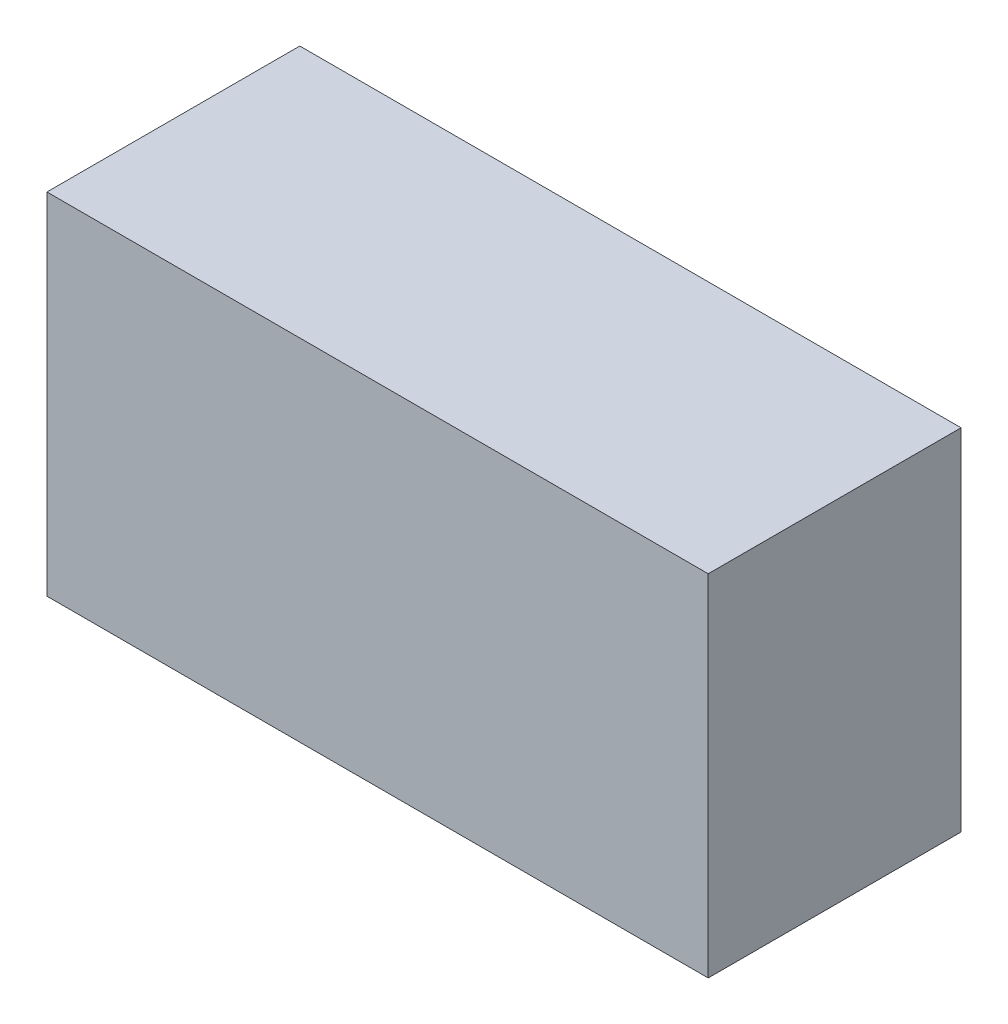
ISO-10303-21;
HEADER;
FILE_DESCRIPTION(('STEP AP214'),'2;1');
FILE_NAME('part.step','',(''),(''),'','','');
FILE_SCHEMA(('AUTOMOTIVE_DESIGN { 1 0 10303 214 1 1 1 1 }'));
ENDSEC;
DATA;
#1=APPLICATION_CONTEXT('core data for automotive mechanical design processes');
#2=APPLICATION_PROTOCOL_DEFINITION('international standard','automotive_design',2000,#1);
#3=PRODUCT_CONTEXT('',#1,'mechanical');
#4=PRODUCT('Part','Part','',(#3));
#5=PRODUCT_RELATED_PRODUCT_CATEGORY('part','',(#4));
#6=PRODUCT_DEFINITION_FORMATION('','',#4);
#7=PRODUCT_DEFINITION_CONTEXT('part definition',#1,'design');
#8=PRODUCT_DEFINITION('design','',#6,#7);
#9=PRODUCT_DEFINITION_SHAPE('','',#8);
#10=(LENGTH_UNIT() NAMED_UNIT(*) SI_UNIT(.MILLI.,.METRE.));
#11=(NAMED_UNIT(*) PLANE_ANGLE_UNIT() SI_UNIT($,.RADIAN.));
#12=(NAMED_UNIT(*) SI_UNIT($,.STERADIAN.) SOLID_ANGLE_UNIT());
#13=UNCERTAINTY_MEASURE_WITH_UNIT(LENGTH_MEASURE(1.E-05),#10,'distance_accuracy_value','');
#14=(GEOMETRIC_REPRESENTATION_CONTEXT(3) GLOBAL_UNCERTAINTY_ASSIGNED_CONTEXT((#13)) GLOBAL_UNIT_ASSIGNED_CONTEXT((#10,
#11,#12)) REPRESENTATION_CONTEXT('',''));
#15=CARTESIAN_POINT('',(0.,0.,0.));
#16=DIRECTION('',(0.,0.,1.));
#17=DIRECTION('',(1.,0.,0.));
#18=AXIS2_PLACEMENT_3D('',#15,#16,#17);
#19=CARTESIAN_POINT('',(-1.69999914,-0.90000074,1.29999994));
#20=DIRECTION('',(0.,0.,-1.));
#21=DIRECTION('',(-1.,0.,0.));
#22=AXIS2_PLACEMENT_3D('',#19,#20,#21);
#23=PLANE('',#22);
#24=DIRECTION('',(0.,1.,0.));
#25=VECTOR('',#24,1.);
#26=CARTESIAN_POINT('',(1.69999914,-0.90000074,1.29999994));
#27=LINE('',#26,#25);
#28=CARTESIAN_POINT('',(1.69999914,-0.90000074,1.29999994));
#29=VERTEX_POINT('',#28);
#30=CARTESIAN_POINT('',(1.69999914,0.90000074,1.29999994));
#31=VERTEX_POINT('',#30);
#32=EDGE_CURVE('E55',#29,#31,#27,.T.);
#33=ORIENTED_EDGE('',*,*,#32,.T.);
#34=DIRECTION('',(1.,0.,0.));
#35=VECTOR('',#34,1.);
#36=CARTESIAN_POINT('',(1.69999914,0.90000074,1.29999994));
#37=LINE('',#36,#35);
#38=CARTESIAN_POINT('',(-1.69999914,0.90000074,1.29999994));
#39=VERTEX_POINT('',#38);
#40=EDGE_CURVE('E57',#31,#39,#37,.F.);
#41=ORIENTED_EDGE('',*,*,#40,.T.);
#42=DIRECTION('',(0.,1.,0.));
#43=VECTOR('',#42,1.);
#44=CARTESIAN_POINT('',(-1.69999914,0.90000074,1.29999994));
#45=LINE('',#44,#43);
#46=CARTESIAN_POINT('',(-1.69999914,-0.90000074,1.29999994));
#47=VERTEX_POINT('',#46);
#48=EDGE_CURVE('E20',#39,#47,#45,.F.);
#49=ORIENTED_EDGE('',*,*,#48,.T.);
#50=DIRECTION('',(1.,0.,0.));
#51=VECTOR('',#50,1.);
#52=CARTESIAN_POINT('',(-1.69999914,-0.90000074,1.29999994));
#53=LINE('',#52,#51);
#54=EDGE_CURVE('E80',#47,#29,#53,.T.);
#55=ORIENTED_EDGE('',*,*,#54,.T.);
#56=EDGE_LOOP('',(#33,#41,#49,#55));
#57=FACE_BOUND('',#56,.T.);
#58=ADVANCED_FACE('F17',(#57),#23,.F.);
#59=CARTESIAN_POINT('',(-1.69999914,0.90000074,0.));
#60=DIRECTION('',(1.,0.,0.));
#61=DIRECTION('',(0.,0.,-1.));
#62=AXIS2_PLACEMENT_3D('',#59,#60,#61);
#63=PLANE('',#62);
#64=DIRECTION('',(0.,0.,1.));
#65=VECTOR('',#64,1.);
#66=CARTESIAN_POINT('',(-1.69999914,-0.90000074,0.));
#67=LINE('',#66,#65);
#68=CARTESIAN_POINT('',(-1.69999914,-0.90000074,0.));
#69=VERTEX_POINT('',#68);
#70=EDGE_CURVE('E68',#69,#47,#67,.T.);
#71=ORIENTED_EDGE('',*,*,#70,.T.);
#72=ORIENTED_EDGE('',*,*,#48,.F.);
#73=DIRECTION('',(0.,0.,-1.));
#74=VECTOR('',#73,1.);
#75=CARTESIAN_POINT('',(-1.69999914,0.90000074,0.));
#76=LINE('',#75,#74);
#77=CARTESIAN_POINT('',(-1.69999914,0.90000074,0.));
#78=VERTEX_POINT('',#77);
#79=EDGE_CURVE('E63',#39,#78,#76,.T.);
#80=ORIENTED_EDGE('',*,*,#79,.T.);
#81=DIRECTION('',(0.,1.,0.));
#82=VECTOR('',#81,1.);
#83=CARTESIAN_POINT('',(-1.69999914,-0.90000074,0.));
#84=LINE('',#83,#82);
#85=EDGE_CURVE('E83',#69,#78,#84,.T.);
#86=ORIENTED_EDGE('',*,*,#85,.F.);
#87=EDGE_LOOP('',(#71,#72,#80,#86));
#88=FACE_BOUND('',#87,.T.);
#89=ADVANCED_FACE('F65',(#88),#63,.F.);
#90=CARTESIAN_POINT('',(1.69999914,0.90000074,0.));
#91=DIRECTION('',(0.,-1.,0.));
#92=DIRECTION('',(0.,0.,-1.));
#93=AXIS2_PLACEMENT_3D('',#90,#91,#92);
#94=PLANE('',#93);
#95=ORIENTED_EDGE('',*,*,#79,.F.);
#96=ORIENTED_EDGE('',*,*,#40,.F.);
#97=DIRECTION('',(0.,0.,1.));
#98=VECTOR('',#97,1.);
#99=CARTESIAN_POINT('',(1.69999914,0.90000074,0.));
#100=LINE('',#99,#98);
#101=CARTESIAN_POINT('',(1.69999914,0.90000074,0.));
#102=VERTEX_POINT('',#101);
#103=EDGE_CURVE('E75',#31,#102,#100,.F.);
#104=ORIENTED_EDGE('',*,*,#103,.T.);
#105=DIRECTION('',(-1.,0.,0.));
#106=VECTOR('',#105,1.);
#107=CARTESIAN_POINT('',(-1.69999914,0.90000074,0.));
#108=LINE('',#107,#106);
#109=EDGE_CURVE('E72',#78,#102,#108,.F.);
#110=ORIENTED_EDGE('',*,*,#109,.F.);
#111=EDGE_LOOP('',(#95,#96,#104,#110));
#112=FACE_BOUND('',#111,.T.);
#113=ADVANCED_FACE('F70',(#112),#94,.F.);
#114=CARTESIAN_POINT('',(1.69999914,-0.90000074,0.));
#115=DIRECTION('',(-1.,0.,0.));
#116=DIRECTION('',(0.,0.,1.));
#117=AXIS2_PLACEMENT_3D('',#114,#115,#116);
#118=PLANE('',#117);
#119=ORIENTED_EDGE('',*,*,#103,.F.);
#120=ORIENTED_EDGE('',*,*,#32,.F.);
#121=DIRECTION('',(0.,0.,1.));
#122=VECTOR('',#121,1.);
#123=CARTESIAN_POINT('',(1.69999914,-0.90000074,0.));
#124=LINE('',#123,#122);
#125=CARTESIAN_POINT('',(1.69999914,-0.90000074,0.));
#126=VERTEX_POINT('',#125);
#127=EDGE_CURVE('E35',#29,#126,#124,.F.);
#128=ORIENTED_EDGE('',*,*,#127,.T.);
#129=DIRECTION('',(0.,1.,0.));
#130=VECTOR('',#129,1.);
#131=CARTESIAN_POINT('',(1.69999914,-0.90000074,0.));
#132=LINE('',#131,#130);
#133=EDGE_CURVE('E26',#102,#126,#132,.F.);
#134=ORIENTED_EDGE('',*,*,#133,.F.);
#135=EDGE_LOOP('',(#119,#120,#128,#134));
#136=FACE_BOUND('',#135,.T.);
#137=ADVANCED_FACE('F89',(#136),#118,.F.);
#138=CARTESIAN_POINT('',(-1.69999914,-0.90000074,0.));
#139=DIRECTION('',(0.,1.,0.));
#140=DIRECTION('',(0.,0.,1.));
#141=AXIS2_PLACEMENT_3D('',#138,#139,#140);
#142=PLANE('',#141);
#143=ORIENTED_EDGE('',*,*,#127,.F.);
#144=ORIENTED_EDGE('',*,*,#54,.F.);
#145=ORIENTED_EDGE('',*,*,#70,.F.);
#146=DIRECTION('',(-1.,0.,0.));
#147=VECTOR('',#146,1.);
#148=CARTESIAN_POINT('',(-1.69999914,-0.90000074,0.));
#149=LINE('',#148,#147);
#150=EDGE_CURVE('E11',#126,#69,#149,.T.);
#151=ORIENTED_EDGE('',*,*,#150,.F.);
#152=EDGE_LOOP('',(#143,#144,#145,#151));
#153=FACE_BOUND('',#152,.T.);
#154=ADVANCED_FACE('F91',(#153),#142,.F.);
#155=CARTESIAN_POINT('',(-1.69999914,-0.90000074,0.));
#156=DIRECTION('',(0.,0.,-1.));
#157=DIRECTION('',(-1.,0.,0.));
#158=AXIS2_PLACEMENT_3D('',#155,#156,#157);
#159=PLANE('',#158);
#160=ORIENTED_EDGE('',*,*,#133,.T.);
#161=ORIENTED_EDGE('',*,*,#150,.T.);
#162=ORIENTED_EDGE('',*,*,#85,.T.);
#163=ORIENTED_EDGE('',*,*,#109,.T.);
#164=EDGE_LOOP('',(#160,#161,#162,#163));
#165=FACE_BOUND('',#164,.T.);
#166=ADVANCED_FACE('F88',(#165),#159,.T.);
#167=CLOSED_SHELL('',(#58,#89,#113,#137,#154,#166));
#168=MANIFOLD_SOLID_BREP('B1',#167);
#169=ADVANCED_BREP_SHAPE_REPRESENTATION('',(#18,#168),#14);
#170=SHAPE_DEFINITION_REPRESENTATION(#9,#169);
ENDSEC;
END-ISO-10303-21;
